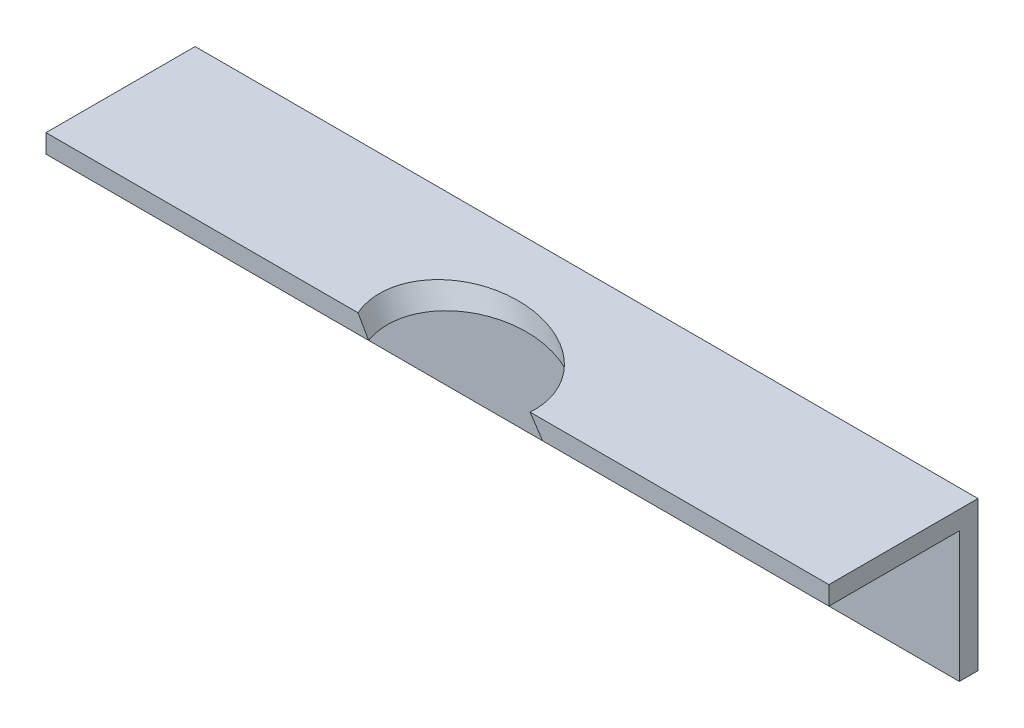
ISO-10303-21;
HEADER;
FILE_DESCRIPTION(('STEP AP214'),'2;1');
FILE_NAME('part.step','',(''),(''),'','','');
FILE_SCHEMA(('AUTOMOTIVE_DESIGN { 1 0 10303 214 1 1 1 1 }'));
ENDSEC;
DATA;
#1=APPLICATION_CONTEXT('core data for automotive mechanical design processes');
#2=APPLICATION_PROTOCOL_DEFINITION('international standard','automotive_design',2000,#1);
#3=PRODUCT_CONTEXT('',#1,'mechanical');
#4=PRODUCT('Part','Part','',(#3));
#5=PRODUCT_RELATED_PRODUCT_CATEGORY('part','',(#4));
#6=PRODUCT_DEFINITION_FORMATION('','',#4);
#7=PRODUCT_DEFINITION_CONTEXT('part definition',#1,'design');
#8=PRODUCT_DEFINITION('design','',#6,#7);
#9=PRODUCT_DEFINITION_SHAPE('','',#8);
#10=(LENGTH_UNIT() NAMED_UNIT(*) SI_UNIT(.MILLI.,.METRE.));
#11=(NAMED_UNIT(*) PLANE_ANGLE_UNIT() SI_UNIT($,.RADIAN.));
#12=(NAMED_UNIT(*) SI_UNIT($,.STERADIAN.) SOLID_ANGLE_UNIT());
#13=UNCERTAINTY_MEASURE_WITH_UNIT(LENGTH_MEASURE(1.E-05),#10,'distance_accuracy_value','');
#14=(GEOMETRIC_REPRESENTATION_CONTEXT(3) GLOBAL_UNCERTAINTY_ASSIGNED_CONTEXT((#13)) GLOBAL_UNIT_ASSIGNED_CONTEXT((#10,
#11,#12)) REPRESENTATION_CONTEXT('',''));
#15=CARTESIAN_POINT('',(0.,0.,0.));
#16=DIRECTION('',(0.,0.,1.));
#17=DIRECTION('',(1.,0.,0.));
#18=AXIS2_PLACEMENT_3D('',#15,#16,#17);
#19=CARTESIAN_POINT('',(133.35,25.4,25.4));
#20=DIRECTION('',(0.,0.,-1.));
#21=DIRECTION('',(0.,1.,0.));
#22=AXIS2_PLACEMENT_3D('',#19,#20,#21);
#23=PLANE('',#22);
#24=DIRECTION('',(-1.,0.,0.));
#25=VECTOR('',#24,1.);
#26=CARTESIAN_POINT('',(133.35,25.4,25.4));
#27=LINE('',#26,#25);
#28=CARTESIAN_POINT('',(133.35,25.4,25.4));
#29=VERTEX_POINT('',#28);
#30=CARTESIAN_POINT('',(82.4507220655502,25.4,25.4));
#31=VERTEX_POINT('',#30);
#32=EDGE_CURVE('E151',#29,#31,#27,.T.);
#33=ORIENTED_EDGE('',*,*,#32,.T.);
#34=CARTESIAN_POINT('',(82.4507220655502,25.4,25.4));
#35=CARTESIAN_POINT('',(82.8118797471835,24.8728206184552,25.4));
#36=CARTESIAN_POINT('',(83.171569617135,24.3446475943495,25.4));
#37=CARTESIAN_POINT('',(83.8880137336743,23.2863142610162,25.4));
#38=CARTESIAN_POINT('',(84.244767980262,22.7561539517886,25.4));
#39=CARTESIAN_POINT('',(84.6000544151679,22.225,25.4));
#40=B_SPLINE_CURVE_WITH_KNOTS('',3,(#34,#35,#36,#37,#38,#39),.UNSPECIFIED.,.F.,.F.,(4,2,4),(0.,
1.91705292400818,3.83410584801635),.UNSPECIFIED.);
#41=CARTESIAN_POINT('',(84.6000544151679,22.225,25.4));
#42=VERTEX_POINT('',#41);
#43=EDGE_CURVE('E191',#31,#42,#40,.T.);
#44=ORIENTED_EDGE('',*,*,#43,.T.);
#45=DIRECTION('',(-1.,0.,0.));
#46=VECTOR('',#45,1.);
#47=CARTESIAN_POINT('',(133.35,22.225,25.4));
#48=LINE('',#47,#46);
#49=CARTESIAN_POINT('',(133.35,22.225,25.4));
#50=VERTEX_POINT('',#49);
#51=EDGE_CURVE('E148',#50,#42,#48,.T.);
#52=ORIENTED_EDGE('',*,*,#51,.F.);
#53=DIRECTION('',(0.,-1.,0.));
#54=VECTOR('',#53,1.);
#55=CARTESIAN_POINT('',(133.35,25.4,25.4));
#56=LINE('',#55,#54);
#57=EDGE_CURVE('E110',#29,#50,#56,.T.);
#58=ORIENTED_EDGE('',*,*,#57,.F.);
#59=EDGE_LOOP('',(#33,#44,#52,#58));
#60=FACE_BOUND('',#59,.T.);
#61=ADVANCED_FACE('F33',(#60),#23,.F.);
#62=CARTESIAN_POINT('',(133.35,0.,0.));
#63=DIRECTION('',(0.,0.,1.));
#64=DIRECTION('',(1.,0.,0.));
#65=AXIS2_PLACEMENT_3D('',#62,#63,#64);
#66=PLANE('',#65);
#67=CARTESIAN_POINT('',(107.95,8.8899999999999,0.));
#68=DIRECTION('',(0.,0.,-1.));
#69=DIRECTION('',(-1.,0.,0.));
#70=AXIS2_PLACEMENT_3D('',#67,#68,#69);
#71=CIRCLE('',#70,3.57123999999994);
#72=CARTESIAN_POINT('',(104.37876,8.8899999999999,0.));
#73=VERTEX_POINT('',#72);
#74=EDGE_CURVE('E228',#73,#73,#71,.T.);
#75=ORIENTED_EDGE('',*,*,#74,.F.);
#76=EDGE_LOOP('',(#75));
#77=FACE_BOUND('',#76,.T.);
#78=CARTESIAN_POINT('',(25.3999999999999,8.8899999999999,0.));
#79=DIRECTION('',(0.,0.,-1.));
#80=DIRECTION('',(-1.,0.,0.));
#81=AXIS2_PLACEMENT_3D('',#78,#79,#80);
#82=CIRCLE('',#81,3.57123999999993);
#83=CARTESIAN_POINT('',(21.82876,8.8899999999999,0.));
#84=VERTEX_POINT('',#83);
#85=EDGE_CURVE('E232',#84,#84,#82,.T.);
#86=ORIENTED_EDGE('',*,*,#85,.F.);
#87=EDGE_LOOP('',(#86));
#88=FACE_BOUND('',#87,.T.);
#89=DIRECTION('',(0.,1.,0.));
#90=VECTOR('',#89,1.);
#91=CARTESIAN_POINT('',(0.,0.,0.));
#92=LINE('',#91,#90);
#93=CARTESIAN_POINT('',(0.,0.,0.));
#94=VERTEX_POINT('',#93);
#95=CARTESIAN_POINT('',(0.,25.4,0.));
#96=VERTEX_POINT('',#95);
#97=EDGE_CURVE('E131',#94,#96,#92,.T.);
#98=ORIENTED_EDGE('',*,*,#97,.T.);
#99=DIRECTION('',(-1.,0.,0.));
#100=VECTOR('',#99,1.);
#101=CARTESIAN_POINT('',(133.35,25.4,0.));
#102=LINE('',#101,#100);
#103=CARTESIAN_POINT('',(133.35,25.4,0.));
#104=VERTEX_POINT('',#103);
#105=EDGE_CURVE('E42',#104,#96,#102,.T.);
#106=ORIENTED_EDGE('',*,*,#105,.F.);
#107=DIRECTION('',(0.,1.,0.));
#108=VECTOR('',#107,1.);
#109=CARTESIAN_POINT('',(133.35,0.,0.));
#110=LINE('',#109,#108);
#111=CARTESIAN_POINT('',(133.35,0.,0.));
#112=VERTEX_POINT('',#111);
#113=EDGE_CURVE('E145',#112,#104,#110,.T.);
#114=ORIENTED_EDGE('',*,*,#113,.F.);
#115=DIRECTION('',(-1.,0.,0.));
#116=VECTOR('',#115,1.);
#117=CARTESIAN_POINT('',(133.35,0.,0.));
#118=LINE('',#117,#116);
#119=EDGE_CURVE('E127',#112,#94,#118,.T.);
#120=ORIENTED_EDGE('',*,*,#119,.T.);
#121=EDGE_LOOP('',(#98,#106,#114,#120));
#122=FACE_BOUND('',#121,.T.);
#123=ADVANCED_FACE('F35',(#77,#88,#122),#66,.F.);
#124=CARTESIAN_POINT('',(133.35,25.4,0.));
#125=DIRECTION('',(0.,-1.,0.));
#126=DIRECTION('',(0.,0.,-1.));
#127=AXIS2_PLACEMENT_3D('',#124,#125,#126);
#128=PLANE('',#127);
#129=CARTESIAN_POINT('',(53.1397448053759,25.4,25.4));
#130=VERTEX_POINT('',#129);
#131=CARTESIAN_POINT('',(0.,25.4,25.4));
#132=VERTEX_POINT('',#131);
#133=EDGE_CURVE('E150',#130,#132,#27,.T.);
#134=ORIENTED_EDGE('',*,*,#133,.F.);
#135=CARTESIAN_POINT('',(53.1397448053759,25.4,25.4));
#136=CARTESIAN_POINT('',(53.0552695525293,25.4,25.2092846286961));
#137=CARTESIAN_POINT('',(52.9753699320881,25.4,25.0165226562854));
#138=CARTESIAN_POINT('',(52.8251621484468,25.4,24.6271083829943));
#139=CARTESIAN_POINT('',(52.7548623501499,25.4,24.4304528580984));
#140=CARTESIAN_POINT('',(52.6244261093709,25.4,24.0337362058139));
#141=CARTESIAN_POINT('',(52.56429221829,25.4,23.8336742373155));
#142=CARTESIAN_POINT('',(52.4543999973871,25.4,23.4294863780168));
#143=CARTESIAN_POINT('',(52.404702970009,25.4,23.225343789415));
#144=CARTESIAN_POINT('',(52.3166298359295,25.4,22.8146701871015));
#145=CARTESIAN_POINT('',(52.2782510744276,25.4,22.608139745312));
#146=CARTESIAN_POINT('',(52.2132726237885,25.4,22.1932550923359));
#147=CARTESIAN_POINT('',(52.1866722493989,25.4,21.9849009879671));
#148=CARTESIAN_POINT('',(52.1352781354408,25.4,21.4608526519612));
#149=CARTESIAN_POINT('',(52.1182549097134,25.4,21.1443554415876));
#150=CARTESIAN_POINT('',(52.113224104259,25.4,20.5111037308574));
#151=CARTESIAN_POINT('',(52.1252187081415,25.4,20.1943492129313));
#152=CARTESIAN_POINT('',(52.1789704034954,25.4,19.5642697870946));
#153=CARTESIAN_POINT('',(52.2206412035858,25.4,19.250937603669));
#154=CARTESIAN_POINT('',(52.3339551784281,25.4,18.6297533473317));
#155=CARTESIAN_POINT('',(52.4055945882224,25.4,18.3219005911026));
#156=CARTESIAN_POINT('',(52.5700792472038,25.4,17.7443569403525));
#157=CARTESIAN_POINT('',(52.660166979867,25.4,17.4738773554164));
#158=CARTESIAN_POINT('',(52.8638408554983,25.4,16.9419276124304));
#159=CARTESIAN_POINT('',(52.9774254352845,25.4,16.6804568563968));
#160=CARTESIAN_POINT('',(53.2271433080984,25.4,16.1683295712757));
#161=CARTESIAN_POINT('',(53.3632902587647,25.4,15.9176797089319));
#162=CARTESIAN_POINT('',(53.6567273821985,25.4,15.4290879616747));
#163=CARTESIAN_POINT('',(53.814017692799,25.4,15.1911461596188));
#164=CARTESIAN_POINT('',(54.142066644654,25.4,14.7377840304562));
#165=CARTESIAN_POINT('',(54.3121310095141,25.4,14.5218601060631));
#166=CARTESIAN_POINT('',(54.6687980015109,25.4,14.1041704392305));
#167=CARTESIAN_POINT('',(54.8553999046154,25.4,13.9024040776491));
#168=CARTESIAN_POINT('',(55.2434548789567,25.4,13.5137908877836));
#169=CARTESIAN_POINT('',(55.4449055297784,25.4,13.3269416382388));
#170=CARTESIAN_POINT('',(55.8610358454027,25.4,12.9685931919558));
#171=CARTESIAN_POINT('',(56.0757170463652,25.4,12.7970957833654));
#172=CARTESIAN_POINT('',(56.5380296178016,25.4000000000001,12.4538792588997));
#173=CARTESIAN_POINT('',(56.7868386611477,25.4,12.2837467602461));
#174=CARTESIAN_POINT('',(57.2963302105876,25.4,11.9624128963433));
#175=CARTESIAN_POINT('',(57.5570118566816,25.4,11.811210162869));
#176=CARTESIAN_POINT('',(58.0885209176122,25.4,11.5275330230548));
#177=CARTESIAN_POINT('',(58.3593533134524,25.4,11.3950679676697));
#178=CARTESIAN_POINT('',(58.9094409292837,25.4,11.148634330679));
#179=CARTESIAN_POINT('',(59.1887006782216,25.4,11.0346759124673));
#180=CARTESIAN_POINT('',(59.8791769581514,25.4000000000001,10.7785196622368));
#181=CARTESIAN_POINT('',(60.2940716090099,25.4,10.6461597976712));
#182=CARTESIAN_POINT('',(61.1339912926882,25.4,10.4179783419546));
#183=CARTESIAN_POINT('',(61.5590234334195,25.4,10.3221832391793));
#184=CARTESIAN_POINT('',(62.4161127357909,25.4,10.1656769656161));
#185=CARTESIAN_POINT('',(62.8481794359177,25.4,10.1050183736042));
#186=CARTESIAN_POINT('',(63.7154943199891,25.4,10.0175842366327));
#187=CARTESIAN_POINT('',(64.150741082516,25.3999999999999,9.99079438582347));
#188=CARTESIAN_POINT('',(65.0276920136996,25.3999999999999,9.96954095578797));
#189=CARTESIAN_POINT('',(65.4694061693629,25.4,9.97550486169905));
#190=CARTESIAN_POINT('',(66.3505781385393,25.4,10.0194150422216));
#191=CARTESIAN_POINT('',(66.7900382743378,25.4,10.0573156027851));
#192=CARTESIAN_POINT('',(67.6652922759608,25.4,10.1638898908685));
#193=CARTESIAN_POINT('',(68.1010853529494,25.4,10.2325700753999));
#194=CARTESIAN_POINT('',(68.9670897707796,25.4,10.3997086354234));
#195=CARTESIAN_POINT('',(69.3972984827243,25.4000000000001,10.4981805407384));
#196=CARTESIAN_POINT('',(70.3303854780158,25.4000000000001,10.7452937521323));
#197=CARTESIAN_POINT('',(70.8317055444677,25.4,10.8998886935695));
#198=CARTESIAN_POINT('',(71.8202192219666,25.4,11.2484998079443));
#199=CARTESIAN_POINT('',(72.307412565401,25.4,11.4425167271237));
#200=CARTESIAN_POINT('',(73.7448688780859,25.4,12.0830239836533));
#201=CARTESIAN_POINT('',(74.6704042264935,25.3999999999999,12.5878106228622));
#202=CARTESIAN_POINT('',(76.0048978462412,25.3999999999999,13.4679616107247));
#203=CARTESIAN_POINT('',(76.4498292033741,25.4,13.7903529057637));
#204=CARTESIAN_POINT('',(77.3086372435164,25.4,14.4746987403101));
#205=CARTESIAN_POINT('',(77.7225081348837,25.4,14.8366606275286));
#206=CARTESIAN_POINT('',(78.5128200901557,25.4,15.5982775955214));
#207=CARTESIAN_POINT('',(78.8893161239713,25.4,15.9978755831172));
#208=CARTESIAN_POINT('',(79.5991911327715,25.4,16.8336073704988));
#209=CARTESIAN_POINT('',(79.9325949647366,25.3999999999999,17.2697198661196));
#210=CARTESIAN_POINT('',(80.4424196385761,25.4,18.0192970843645));
#211=CARTESIAN_POINT('',(80.6332587927835,25.4,18.3230271137844));
#212=CARTESIAN_POINT('',(80.9912287489623,25.4,18.9443267306675));
#213=CARTESIAN_POINT('',(81.1583540004886,25.4,19.2618995354904));
#214=CARTESIAN_POINT('',(81.4659098385346,25.4,19.908548663991));
#215=CARTESIAN_POINT('',(81.6064213640543,25.3999999999999,20.2375863842769));
#216=CARTESIAN_POINT('',(81.8588067008189,25.4000000000001,20.9063245094951));
#217=CARTESIAN_POINT('',(81.9706964759067,25.4000000000002,21.2460188514523));
#218=CARTESIAN_POINT('',(82.1531814851614,25.4000000000002,21.8976933773082));
#219=CARTESIAN_POINT('',(82.2268946989515,25.4000000000001,22.2087996110938));
#220=CARTESIAN_POINT('',(82.3477095113493,25.3999999999999,22.8360618936138));
#221=CARTESIAN_POINT('',(82.3948197736599,25.4,23.1522162638066));
#222=CARTESIAN_POINT('',(82.4611473925533,25.4,23.7901535391024));
#223=CARTESIAN_POINT('',(82.4801322745511,25.4,24.1119613488938));
#224=CARTESIAN_POINT('',(82.4861573473346,25.4,24.5950430954171));
#225=CARTESIAN_POINT('',(82.4844150880635,25.4,24.7562384830823));
#226=CARTESIAN_POINT('',(82.4733120237959,25.4,25.07838590219));
#227=CARTESIAN_POINT('',(82.4639502645222,25.4,25.2393379006205));
#228=CARTESIAN_POINT('',(82.4507220655502,25.4,25.4));
#229=B_SPLINE_CURVE_WITH_KNOTS('',3,(#135,#136,#137,#138,#139,#140,#141,#142,#143,#144,#145,
#146,#147,#148,#149,#150,#151,#152,#153,#154,#155,#156,#157,#158,#159,#160,#161,#162,#163,#164,
#165,#166,#167,#168,#169,#170,#171,#172,#173,#174,#175,#176,#177,#178,#179,#180,#181,#182,#183,
#184,#185,#186,#187,#188,#189,#190,#191,#192,#193,#194,#195,#196,#197,#198,#199,#200,#201,#202,
#203,#204,#205,#206,#207,#208,#209,#210,#211,#212,#213,#214,#215,#216,#217,#218,#219,#220,#221,
#222,#223,#224,#225,#226,#227,#228),.UNSPECIFIED.,.F.,.F.,(4,2,2,2,2,2,2,2,2,2,2,2,2,2,2,2,2,2,
2,2,2,2,2,2,2,2,2,2,2,2,2,2,2,2,2,2,2,2,2,2,2,2,2,2,2,2,4),(0.,0.625727080004167,
1.25199596120217,1.87842178840924,2.50843002104645,3.13829036188124,3.76811405339389,
4.71762910508194,5.66721561057894,6.61405215746437,7.56076978893849,8.41494236581361,
9.26905813515962,10.1236928261247,10.9783330886971,11.8020146330625,12.6256601335095,
13.4491716715421,14.2727790058566,15.1761391604233,16.0794339832526,16.9831780128902,
17.8874166905106,19.1920316409069,20.4975898995041,21.8050968004528,23.1120512376,
24.4361035721046,25.7582638745308,27.0807016723369,28.4037409552494,29.9757312329026,
31.5477512704561,34.6936459326471,36.3402549250912,37.9871701910278,39.6316261703228,
41.2751292998826,42.3503366889633,43.425795326015,44.4979287752702,45.5694629294943,
46.5275392558605,47.4853033881926,48.4509407337449,48.9343977251273,49.4179152746838),.UNSPECIFIED.);
#230=EDGE_CURVE('E135',#130,#31,#229,.T.);
#231=ORIENTED_EDGE('',*,*,#230,.T.);
#232=ORIENTED_EDGE('',*,*,#32,.F.);
#233=DIRECTION('',(0.,0.,1.));
#234=VECTOR('',#233,1.);
#235=CARTESIAN_POINT('',(133.35,25.4,0.));
#236=LINE('',#235,#234);
#237=EDGE_CURVE('E94',#104,#29,#236,.T.);
#238=ORIENTED_EDGE('',*,*,#237,.F.);
#239=ORIENTED_EDGE('',*,*,#105,.T.);
#240=DIRECTION('',(0.,0.,1.));
#241=VECTOR('',#240,1.);
#242=CARTESIAN_POINT('',(0.,25.4,0.));
#243=LINE('',#242,#241);
#244=EDGE_CURVE('E134',#96,#132,#243,.T.);
#245=ORIENTED_EDGE('',*,*,#244,.T.);
#246=EDGE_LOOP('',(#134,#231,#232,#238,#239,#245));
#247=FACE_BOUND('',#246,.T.);
#248=ADVANCED_FACE('F205',(#247),#128,.F.);
#249=CARTESIAN_POINT('',(54.9615962161696,22.225,25.4));
#250=VERTEX_POINT('',#249);
#251=CARTESIAN_POINT('',(0.,22.225,25.4));
#252=VERTEX_POINT('',#251);
#253=EDGE_CURVE('E122',#250,#252,#48,.T.);
#254=ORIENTED_EDGE('',*,*,#253,.F.);
#255=CARTESIAN_POINT('',(54.9615962161696,22.225,25.4));
#256=CARTESIAN_POINT('',(54.654733843365,22.7523187234714,25.4));
#257=CARTESIAN_POINT('',(54.3494817060633,23.2805614185405,25.4));
#258=CARTESIAN_POINT('',(53.7421979024654,24.3388947518738,25.4));
#259=CARTESIAN_POINT('',(53.4401662361692,24.8689853901381,25.4));
#260=CARTESIAN_POINT('',(53.1397448053759,25.4000000000001,25.4));
#261=B_SPLINE_CURVE_WITH_KNOTS('',3,(#255,#256,#257,#258,#259,#260),.UNSPECIFIED.,.F.,.F.,(4,2,
4),(0.,1.83029312133053,3.66058624266107),.UNSPECIFIED.);
#262=EDGE_CURVE('E50',#250,#130,#261,.T.);
#263=ORIENTED_EDGE('',*,*,#262,.T.);
#264=ORIENTED_EDGE('',*,*,#133,.T.);
#265=DIRECTION('',(0.,-1.,0.));
#266=VECTOR('',#265,1.);
#267=CARTESIAN_POINT('',(0.,25.4,25.4));
#268=LINE('',#267,#266);
#269=EDGE_CURVE('E138',#132,#252,#268,.T.);
#270=ORIENTED_EDGE('',*,*,#269,.T.);
#271=EDGE_LOOP('',(#254,#263,#264,#270));
#272=FACE_BOUND('',#271,.T.);
#273=ADVANCED_FACE('F202',(#272),#23,.F.);
#274=CARTESIAN_POINT('',(133.35,22.225,25.4));
#275=DIRECTION('',(0.,1.,0.));
#276=DIRECTION('',(0.,0.,1.));
#277=AXIS2_PLACEMENT_3D('',#274,#275,#276);
#278=PLANE('',#277);
#279=ORIENTED_EDGE('',*,*,#51,.T.);
#280=CARTESIAN_POINT('',(84.6000544151679,22.225,25.4));
#281=CARTESIAN_POINT('',(84.6019201147916,22.225,25.2326879081187));
#282=CARTESIAN_POINT('',(84.5997059921209,22.225,25.0653614353125));
#283=CARTESIAN_POINT('',(84.5872894674966,22.225,24.7310263676067));
#284=CARTESIAN_POINT('',(84.5770881377884,22.225,24.5640177330552));
#285=CARTESIAN_POINT('',(84.5347972351034,22.225,24.0643680814026));
#286=CARTESIAN_POINT('',(84.4910248064768,22.225,23.7326528881341));
#287=CARTESIAN_POINT('',(84.3745049552285,22.225,23.0770291272172));
#288=CARTESIAN_POINT('',(84.3019780745371,22.225,22.7530805957786));
#289=CARTESIAN_POINT('',(84.1298668790251,22.225,22.1123886397307));
#290=CARTESIAN_POINT('',(84.0302753269008,22.225,21.7956471669323));
#291=CARTESIAN_POINT('',(83.8065792773056,22.225,21.1726070143354));
#292=CARTESIAN_POINT('',(83.6825886825898,22.225,20.8662672858908));
#293=CARTESIAN_POINT('',(83.4118469967332,22.225,20.263925297187));
#294=CARTESIAN_POINT('',(83.2650975939175,22.225,19.9679222721101));
#295=CARTESIAN_POINT('',(82.7929774894036,22.225,19.0958597658739));
#296=CARTESIAN_POINT('',(82.4360703507517,22.225,18.5366569245894));
#297=CARTESIAN_POINT('',(81.5899247021563,22.225,17.3841629702611));
#298=CARTESIAN_POINT('',(81.0886469346125,22.225,16.7997578931046));
#299=CARTESIAN_POINT('',(80.2809070919732,22.225,15.9791730633643));
#300=CARTESIAN_POINT('',(80.0022584859984,22.225,15.7149063153718));
#301=CARTESIAN_POINT('',(79.4281445124532,22.225,15.2052872152003));
#302=CARTESIAN_POINT('',(79.1326768272365,22.225,14.9599374807812));
#303=CARTESIAN_POINT('',(78.0940516402833,22.225,14.1520038114127));
#304=CARTESIAN_POINT('',(77.3134984498612,22.225,13.6361344376362));
#305=CARTESIAN_POINT('',(76.0937642341189,22.225,12.9516363657429));
#306=CARTESIAN_POINT('',(75.6786783970896,22.225,12.7382177319051));
#307=CARTESIAN_POINT('',(74.8341565377752,22.225,12.3415825797413));
#308=CARTESIAN_POINT('',(74.4047200460763,22.225,12.1583670505322));
#309=CARTESIAN_POINT('',(73.4694876096816,22.225,11.798128030567));
#310=CARTESIAN_POINT('',(72.9617930678114,22.225,11.6260296183342));
#311=CARTESIAN_POINT('',(71.9339395471687,22.225,11.3239243523211));
#312=CARTESIAN_POINT('',(71.4137786986021,22.225,11.1939238556886));
#313=CARTESIAN_POINT('',(70.3644685669921,22.225,10.9775836403659));
#314=CARTESIAN_POINT('',(69.8353198309726,22.225,10.8912412743113));
#315=CARTESIAN_POINT('',(68.7716198872096,22.225,10.7640340898946));
#316=CARTESIAN_POINT('',(68.2370697856006,22.225,10.7231601432639));
#317=CARTESIAN_POINT('',(67.2526451495734,22.225,10.6917334120324));
#318=CARTESIAN_POINT('',(66.8029886013078,22.225,10.6941406758274));
#319=CARTESIAN_POINT('',(65.9051685304766,22.225,10.7338548551416));
#320=CARTESIAN_POINT('',(65.4570049754141,22.225,10.7711610059939));
#321=CARTESIAN_POINT('',(64.5655908166525,22.225,10.8821483471471));
#322=CARTESIAN_POINT('',(64.12233600949,22.225,10.955795479418));
#323=CARTESIAN_POINT('',(63.2438504180335,22.225,11.1410311973418));
#324=CARTESIAN_POINT('',(62.8086174261789,22.2250000000001,11.2526091751774));
#325=CARTESIAN_POINT('',(62.0383064693583,22.2250000000001,11.4882878712448));
#326=CARTESIAN_POINT('',(61.7009975262504,22.225,11.6051248228368));
#327=CARTESIAN_POINT('',(61.0363513393261,22.225,11.8644446085674));
#328=CARTESIAN_POINT('',(60.7090134080653,22.225,12.0069256699905));
#329=CARTESIAN_POINT('',(60.0672802975404,22.225,12.3179488946162));
#330=CARTESIAN_POINT('',(59.7528739275185,22.225,12.4864678974696));
#331=CARTESIAN_POINT('',(59.1397244437903,22.225,12.8499624476503));
#332=CARTESIAN_POINT('',(58.8409789982468,22.225,13.0449340407119));
#333=CARTESIAN_POINT('',(58.3087850698392,22.225,13.427921514475));
#334=CARTESIAN_POINT('',(58.0725389473496,22.225,13.6120553954593));
#335=CARTESIAN_POINT('',(57.61553672383,22.225,13.9986138860342));
#336=CARTESIAN_POINT('',(57.3947778778301,22.225,14.2010352397229));
#337=CARTESIAN_POINT('',(56.9709081820165,22.225,14.6235516445335));
#338=CARTESIAN_POINT('',(56.7677946184522,22.225,14.8436439679001));
#339=CARTESIAN_POINT('',(56.3813212778875,22.225,15.3005749068406));
#340=CARTESIAN_POINT('',(56.1979617618816,22.2250000000001,15.5374137436045));
#341=CARTESIAN_POINT('',(55.8521467434925,22.2250000000001,16.0277653122047));
#342=CARTESIAN_POINT('',(55.6898048913387,22.225,16.2813583387639));
#343=CARTESIAN_POINT('',(55.3890045732788,22.225,16.8023539474753));
#344=CARTESIAN_POINT('',(55.2505462610542,22.225,17.0697566184728));
#345=CARTESIAN_POINT('',(54.9991195911251,22.225,17.6160732702477));
#346=CARTESIAN_POINT('',(54.886133921645,22.225,17.8949792796788));
#347=CARTESIAN_POINT('',(54.6866240911899,22.225,18.4620853390018));
#348=CARTESIAN_POINT('',(54.6000980101564,22.2249999999999,18.7502847128357));
#349=CARTESIAN_POINT('',(54.4603895759089,22.2249999999999,19.3082726247464));
#350=CARTESIAN_POINT('',(54.4049753637224,22.225,19.5775057838099));
#351=CARTESIAN_POINT('',(54.3168047749296,22.225,20.1196400702131));
#352=CARTESIAN_POINT('',(54.2840473329039,22.225,20.3925410244619));
#353=CARTESIAN_POINT('',(54.2409121771935,22.225,20.9404586584604));
#354=CARTESIAN_POINT('',(54.2305646630344,22.225,21.2154776926064));
#355=CARTESIAN_POINT('',(54.2317953793251,22.2249999999999,21.7654424101085));
#356=CARTESIAN_POINT('',(54.2433728745329,22.2249999999998,22.0403880956151));
#357=CARTESIAN_POINT('',(54.2868597940276,22.2249999999998,22.5785201894787));
#358=CARTESIAN_POINT('',(54.3180102081065,22.2249999999999,22.8417689365341));
#359=CARTESIAN_POINT('',(54.3990852585196,22.225,23.3653764505094));
#360=CARTESIAN_POINT('',(54.4490119884664,22.225,23.625734891818));
#361=CARTESIAN_POINT('',(54.5664744071457,22.225,24.1414476234827));
#362=CARTESIAN_POINT('',(54.6339467031406,22.225,24.3968164415759));
#363=CARTESIAN_POINT('',(54.7855397072648,22.225,24.9024432268069));
#364=CARTESIAN_POINT('',(54.8696527052955,22.225,25.1527035018558));
#365=CARTESIAN_POINT('',(54.9615962161696,22.225,25.4));
#366=B_SPLINE_CURVE_WITH_KNOTS('',3,(#280,#281,#282,#283,#284,#285,#286,#287,#288,#289,#290,
#291,#292,#293,#294,#295,#296,#297,#298,#299,#300,#301,#302,#303,#304,#305,#306,#307,#308,#309,
#310,#311,#312,#313,#314,#315,#316,#317,#318,#319,#320,#321,#322,#323,#324,#325,#326,#327,#328,
#329,#330,#331,#332,#333,#334,#335,#336,#337,#338,#339,#340,#341,#342,#343,#344,#345,#346,#347,
#348,#349,#350,#351,#352,#353,#354,#355,#356,#357,#358,#359,#360,#361,#362,#363,#364,#365),
.UNSPECIFIED.,.F.,.F.,(4,2,2,2,2,2,2,2,2,2,2,2,2,2,2,2,2,2,2,2,2,2,2,2,2,2,2,2,2,2,2,2,2,2,2,2,
2,2,2,2,2,2,4),(0.,0.501860156152582,1.00365295146521,2.00589267024633,3.00058964026639,
3.99555286217094,4.98597698300612,5.97632766594873,7.95991029238195,10.2612023202786,
11.4125855746156,12.5641278739005,15.3583044101063,16.757667460777,18.1570763298742,
19.7634935585,21.3701532569607,22.9767155182704,24.5829551868846,25.9306880340277,
27.2783913517892,28.6248340213504,29.9709004513719,31.0408491198542,32.1107238537476,
33.1796523714203,34.2484212760001,35.1461169766888,36.0436531654085,36.9410510725618,
37.8384608348687,38.7405367863479,39.6426185421213,40.5440853624103,41.4454867516042,
42.2691601146852,43.0927947424398,43.9175386079411,44.7422548166424,45.5368116120856,
46.331457029147,47.123270319574,47.9147175965344),.UNSPECIFIED.);
#367=EDGE_CURVE('E11',#42,#250,#366,.T.);
#368=ORIENTED_EDGE('',*,*,#367,.T.);
#369=ORIENTED_EDGE('',*,*,#253,.T.);
#370=DIRECTION('',(0.,0.,-1.));
#371=VECTOR('',#370,1.);
#372=CARTESIAN_POINT('',(0.,22.225,25.4));
#373=LINE('',#372,#371);
#374=CARTESIAN_POINT('',(0.,22.225,3.175));
#375=VERTEX_POINT('',#374);
#376=EDGE_CURVE('E119',#252,#375,#373,.T.);
#377=ORIENTED_EDGE('',*,*,#376,.T.);
#378=DIRECTION('',(-1.,0.,0.));
#379=VECTOR('',#378,1.);
#380=CARTESIAN_POINT('',(133.35,22.225,3.175));
#381=LINE('',#380,#379);
#382=CARTESIAN_POINT('',(133.35,22.225,3.175));
#383=VERTEX_POINT('',#382);
#384=EDGE_CURVE('E116',#383,#375,#381,.T.);
#385=ORIENTED_EDGE('',*,*,#384,.F.);
#386=DIRECTION('',(0.,0.,-1.));
#387=VECTOR('',#386,1.);
#388=CARTESIAN_POINT('',(133.35,22.225,25.4));
#389=LINE('',#388,#387);
#390=EDGE_CURVE('E103',#50,#383,#389,.T.);
#391=ORIENTED_EDGE('',*,*,#390,.F.);
#392=EDGE_LOOP('',(#279,#368,#369,#377,#385,#391));
#393=FACE_BOUND('',#392,.T.);
#394=ADVANCED_FACE('F117',(#393),#278,.F.);
#395=CARTESIAN_POINT('',(133.35,22.225,3.175));
#396=DIRECTION('',(0.,0.,-1.));
#397=DIRECTION('',(0.,1.,0.));
#398=AXIS2_PLACEMENT_3D('',#395,#396,#397);
#399=PLANE('',#398);
#400=CARTESIAN_POINT('',(107.95,8.8899999999999,3.175));
#401=DIRECTION('',(0.,0.,-1.));
#402=DIRECTION('',(0.,1.,0.));
#403=AXIS2_PLACEMENT_3D('',#400,#401,#402);
#404=CIRCLE('',#403,3.57123999999994);
#405=CARTESIAN_POINT('',(107.95,12.4612399999998,3.175));
#406=VERTEX_POINT('',#405);
#407=EDGE_CURVE('E37',#406,#406,#404,.T.);
#408=ORIENTED_EDGE('',*,*,#407,.T.);
#409=EDGE_LOOP('',(#408));
#410=FACE_BOUND('',#409,.T.);
#411=CARTESIAN_POINT('',(25.3999999999999,8.8899999999999,3.175));
#412=DIRECTION('',(0.,0.,-1.));
#413=DIRECTION('',(0.,1.,0.));
#414=AXIS2_PLACEMENT_3D('',#411,#412,#413);
#415=CIRCLE('',#414,3.57123999999993);
#416=CARTESIAN_POINT('',(25.3999999999999,12.4612399999998,3.175));
#417=VERTEX_POINT('',#416);
#418=EDGE_CURVE('E160',#417,#417,#415,.T.);
#419=ORIENTED_EDGE('',*,*,#418,.T.);
#420=EDGE_LOOP('',(#419));
#421=FACE_BOUND('',#420,.T.);
#422=DIRECTION('',(0.,-1.,0.));
#423=VECTOR('',#422,1.);
#424=CARTESIAN_POINT('',(0.,22.225,3.175));
#425=LINE('',#424,#423);
#426=CARTESIAN_POINT('',(0.,0.,3.175));
#427=VERTEX_POINT('',#426);
#428=EDGE_CURVE('E142',#375,#427,#425,.T.);
#429=ORIENTED_EDGE('',*,*,#428,.T.);
#430=DIRECTION('',(-1.,0.,0.));
#431=VECTOR('',#430,1.);
#432=CARTESIAN_POINT('',(133.35,0.,3.175));
#433=LINE('',#432,#431);
#434=CARTESIAN_POINT('',(133.35,0.,3.175));
#435=VERTEX_POINT('',#434);
#436=EDGE_CURVE('E123',#435,#427,#433,.T.);
#437=ORIENTED_EDGE('',*,*,#436,.F.);
#438=DIRECTION('',(0.,-1.,0.));
#439=VECTOR('',#438,1.);
#440=CARTESIAN_POINT('',(133.35,22.225,3.175));
#441=LINE('',#440,#439);
#442=EDGE_CURVE('E107',#383,#435,#441,.T.);
#443=ORIENTED_EDGE('',*,*,#442,.F.);
#444=ORIENTED_EDGE('',*,*,#384,.T.);
#445=EDGE_LOOP('',(#429,#437,#443,#444));
#446=FACE_BOUND('',#445,.T.);
#447=ADVANCED_FACE('F125',(#410,#421,#446),#399,.F.);
#448=CARTESIAN_POINT('',(133.35,0.,3.175));
#449=DIRECTION('',(0.,1.,0.));
#450=DIRECTION('',(0.,0.,1.));
#451=AXIS2_PLACEMENT_3D('',#448,#449,#450);
#452=PLANE('',#451);
#453=DIRECTION('',(0.,0.,-1.));
#454=VECTOR('',#453,1.);
#455=CARTESIAN_POINT('',(0.,0.,3.175));
#456=LINE('',#455,#454);
#457=EDGE_CURVE('E85',#427,#94,#456,.T.);
#458=ORIENTED_EDGE('',*,*,#457,.T.);
#459=ORIENTED_EDGE('',*,*,#119,.F.);
#460=DIRECTION('',(0.,0.,-1.));
#461=VECTOR('',#460,1.);
#462=CARTESIAN_POINT('',(133.35,0.,3.175));
#463=LINE('',#462,#461);
#464=EDGE_CURVE('E58',#435,#112,#463,.T.);
#465=ORIENTED_EDGE('',*,*,#464,.F.);
#466=ORIENTED_EDGE('',*,*,#436,.T.);
#467=EDGE_LOOP('',(#458,#459,#465,#466));
#468=FACE_BOUND('',#467,.T.);
#469=ADVANCED_FACE('F247',(#468),#452,.F.);
#470=CARTESIAN_POINT('',(133.35,0.,0.));
#471=DIRECTION('',(1.,0.,0.));
#472=DIRECTION('',(0.,0.,-1.));
#473=AXIS2_PLACEMENT_3D('',#470,#471,#472);
#474=PLANE('',#473);
#475=ORIENTED_EDGE('',*,*,#113,.T.);
#476=ORIENTED_EDGE('',*,*,#237,.T.);
#477=ORIENTED_EDGE('',*,*,#57,.T.);
#478=ORIENTED_EDGE('',*,*,#390,.T.);
#479=ORIENTED_EDGE('',*,*,#442,.T.);
#480=ORIENTED_EDGE('',*,*,#464,.T.);
#481=EDGE_LOOP('',(#475,#476,#477,#478,#479,#480));
#482=FACE_BOUND('',#481,.T.);
#483=ADVANCED_FACE('F105',(#482),#474,.T.);
#484=CARTESIAN_POINT('',(0.,0.,0.));
#485=DIRECTION('',(1.,0.,0.));
#486=DIRECTION('',(0.,0.,-1.));
#487=AXIS2_PLACEMENT_3D('',#484,#485,#486);
#488=PLANE('',#487);
#489=ORIENTED_EDGE('',*,*,#97,.F.);
#490=ORIENTED_EDGE('',*,*,#457,.F.);
#491=ORIENTED_EDGE('',*,*,#428,.F.);
#492=ORIENTED_EDGE('',*,*,#376,.F.);
#493=ORIENTED_EDGE('',*,*,#269,.F.);
#494=ORIENTED_EDGE('',*,*,#244,.F.);
#495=EDGE_LOOP('',(#489,#490,#491,#492,#493,#494));
#496=FACE_BOUND('',#495,.T.);
#497=ADVANCED_FACE('F172',(#496),#488,.F.);
#498=CARTESIAN_POINT('',(313.868695545001,-367.401209175384,110.125818187158));
#499=CARTESIAN_POINT('',(-146.659751188789,323.693531683085,-46.998545782906));
#500=CARTESIAN_POINT('',(314.822976006317,-368.561544306198,135.481349559727));
#501=CARTESIAN_POINT('',(-145.705470727472,322.533196552272,-21.6430144103366));
#502=CARTESIAN_POINT('',(334.440699372414,-352.427576104565,135.481349559727));
#503=CARTESIAN_POINT('',(-126.087747361375,338.667164753904,-21.6430144103366));
#504=CARTESIAN_POINT('',(333.486418911098,-351.267240973752,110.125818187158));
#505=CARTESIAN_POINT('',(-127.042027822692,339.827499884718,-46.998545782906));
#506=CARTESIAN_POINT('',(332.532138449782,-350.106905842939,84.7702868145884));
#507=CARTESIAN_POINT('',(-127.996308284008,340.987835015531,-72.3540771554754));
#508=CARTESIAN_POINT('',(312.914415083685,-366.240874044571,84.7702868145884));
#509=CARTESIAN_POINT('',(-147.614031650105,324.853866813898,-72.3540771554754));
#510=CARTESIAN_POINT('',(313.868695545001,-367.401209175384,110.125818187158));
#511=CARTESIAN_POINT('',(-146.659751188789,323.693531683085,-46.998545782906));
#512=(BOUNDED_SURFACE() B_SPLINE_SURFACE(3,1,((#498,#499),(#500,#501),(#502,#503),(#504,#505),
(#506,#507),(#508,#509),(#510,#511)),.UNSPECIFIED.,.T.,.F.,.F.) B_SPLINE_SURFACE_WITH_KNOTS((4,
3,4),(2,2),(0.,0.5,1.),(0.,1.),
.UNSPECIFIED.) GEOMETRIC_REPRESENTATION_ITEM() RATIONAL_B_SPLINE_SURFACE(((1.,1.),
(0.333333333333333,0.333333333333333),(0.333333333333333,0.333333333333333),(1.,1.),
(0.333333333333333,0.333333333333333),(0.333333333333333,0.333333333333333),(1.,1.))) REPRESENTATION_ITEM('') SURFACE());
#513=ORIENTED_EDGE('',*,*,#262,.F.);
#514=ORIENTED_EDGE('',*,*,#367,.F.);
#515=ORIENTED_EDGE('',*,*,#43,.F.);
#516=ORIENTED_EDGE('',*,*,#230,.F.);
#517=EDGE_LOOP('',(#513,#514,#515,#516));
#518=FACE_BOUND('',#517,.T.);
#519=ADVANCED_FACE('F164',(#518),#512,.F.);
#520=CARTESIAN_POINT('',(25.3999999999999,8.8899999999999,26.7186887893807));
#521=DIRECTION('',(0.,0.,-1.));
#522=DIRECTION('',(-1.,0.,0.));
#523=AXIS2_PLACEMENT_3D('',#520,#521,#522);
#524=CYLINDRICAL_SURFACE('',#523,3.57123999999993);
#525=ORIENTED_EDGE('',*,*,#85,.T.);
#526=EDGE_LOOP('',(#525));
#527=FACE_BOUND('',#526,.T.);
#528=ORIENTED_EDGE('',*,*,#418,.F.);
#529=EDGE_LOOP('',(#528));
#530=FACE_BOUND('',#529,.T.);
#531=ADVANCED_FACE('F171',(#527,#530),#524,.F.);
#532=CARTESIAN_POINT('',(107.95,8.8899999999999,26.7186887893807));
#533=DIRECTION('',(0.,0.,-1.));
#534=DIRECTION('',(-1.,0.,0.));
#535=AXIS2_PLACEMENT_3D('',#532,#533,#534);
#536=CYLINDRICAL_SURFACE('',#535,3.57123999999994);
#537=ORIENTED_EDGE('',*,*,#74,.T.);
#538=EDGE_LOOP('',(#537));
#539=FACE_BOUND('',#538,.T.);
#540=ORIENTED_EDGE('',*,*,#407,.F.);
#541=EDGE_LOOP('',(#540));
#542=FACE_BOUND('',#541,.T.);
#543=ADVANCED_FACE('F272',(#539,#542),#536,.F.);
#544=CLOSED_SHELL('',(#61,#123,#248,#273,#394,#447,#469,#483,#497,#519,#531,#543));
#545=MANIFOLD_SOLID_BREP('B2',#544);
#546=ADVANCED_BREP_SHAPE_REPRESENTATION('',(#18,#545),#14);
#547=SHAPE_DEFINITION_REPRESENTATION(#9,#546);
ENDSEC;
END-ISO-10303-21;
